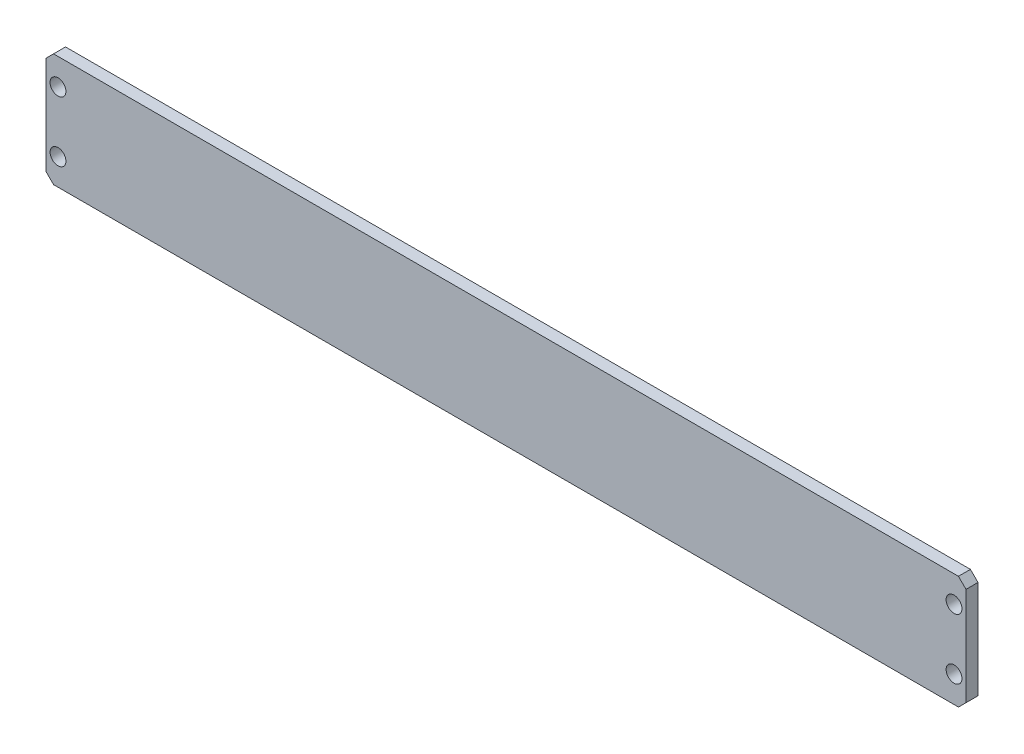
ISO-10303-21;
HEADER;
FILE_DESCRIPTION(('STEP AP214'),'2;1');
FILE_NAME('part.step','',(''),(''),'','','');
FILE_SCHEMA(('AUTOMOTIVE_DESIGN { 1 0 10303 214 1 1 1 1 }'));
ENDSEC;
DATA;
#1=APPLICATION_CONTEXT('core data for automotive mechanical design processes');
#2=APPLICATION_PROTOCOL_DEFINITION('international standard','automotive_design',2000,#1);
#3=PRODUCT_CONTEXT('',#1,'mechanical');
#4=PRODUCT('Part','Part','',(#3));
#5=PRODUCT_RELATED_PRODUCT_CATEGORY('part','',(#4));
#6=PRODUCT_DEFINITION_FORMATION('','',#4);
#7=PRODUCT_DEFINITION_CONTEXT('part definition',#1,'design');
#8=PRODUCT_DEFINITION('design','',#6,#7);
#9=PRODUCT_DEFINITION_SHAPE('','',#8);
#10=(LENGTH_UNIT() NAMED_UNIT(*) SI_UNIT(.MILLI.,.METRE.));
#11=(NAMED_UNIT(*) PLANE_ANGLE_UNIT() SI_UNIT($,.RADIAN.));
#12=(NAMED_UNIT(*) SI_UNIT($,.STERADIAN.) SOLID_ANGLE_UNIT());
#13=UNCERTAINTY_MEASURE_WITH_UNIT(LENGTH_MEASURE(1.E-05),#10,'distance_accuracy_value','');
#14=(GEOMETRIC_REPRESENTATION_CONTEXT(3) GLOBAL_UNCERTAINTY_ASSIGNED_CONTEXT((#13)) GLOBAL_UNIT_ASSIGNED_CONTEXT((#10,
#11,#12)) REPRESENTATION_CONTEXT('',''));
#15=CARTESIAN_POINT('',(0.,0.,0.));
#16=DIRECTION('',(0.,0.,1.));
#17=DIRECTION('',(1.,0.,0.));
#18=AXIS2_PLACEMENT_3D('',#15,#16,#17);
#19=CARTESIAN_POINT('',(0.,131.786291501019,3.175));
#20=DIRECTION('',(1.,0.,0.));
#21=DIRECTION('',(0.,0.,-1.));
#22=AXIS2_PLACEMENT_3D('',#19,#20,#21);
#23=PLANE('',#22);
#24=DIRECTION('',(0.,-1.,0.));
#25=VECTOR('',#24,1.);
#26=CARTESIAN_POINT('',(0.,131.786291501019,0.));
#27=LINE('',#26,#25);
#28=CARTESIAN_POINT('',(0.,129.786291501019,0.));
#29=VERTEX_POINT('',#28);
#30=CARTESIAN_POINT('',(0.,103.786291501019,0.));
#31=VERTEX_POINT('',#30);
#32=EDGE_CURVE('E129',#29,#31,#27,.T.);
#33=ORIENTED_EDGE('',*,*,#32,.T.);
#34=DIRECTION('',(0.,0.,1.));
#35=VECTOR('',#34,1.);
#36=CARTESIAN_POINT('',(0.,103.786291501019,3.175));
#37=LINE('',#36,#35);
#38=CARTESIAN_POINT('',(0.,103.786291501019,3.175));
#39=VERTEX_POINT('',#38);
#40=EDGE_CURVE('E11',#31,#39,#37,.T.);
#41=ORIENTED_EDGE('',*,*,#40,.T.);
#42=DIRECTION('',(0.,-1.,0.));
#43=VECTOR('',#42,1.);
#44=CARTESIAN_POINT('',(0.,131.786291501019,3.175));
#45=LINE('',#44,#43);
#46=CARTESIAN_POINT('',(0.,129.786291501019,3.175));
#47=VERTEX_POINT('',#46);
#48=EDGE_CURVE('E127',#47,#39,#45,.T.);
#49=ORIENTED_EDGE('',*,*,#48,.F.);
#50=DIRECTION('',(0.,0.,-1.));
#51=VECTOR('',#50,1.);
#52=CARTESIAN_POINT('',(0.,129.786291501019,3.175));
#53=LINE('',#52,#51);
#54=EDGE_CURVE('E41',#47,#29,#53,.T.);
#55=ORIENTED_EDGE('',*,*,#54,.T.);
#56=EDGE_LOOP('',(#33,#41,#49,#55));
#57=FACE_BOUND('',#56,.T.);
#58=ADVANCED_FACE('F33',(#57),#23,.F.);
#59=CARTESIAN_POINT('',(0.,101.786291501019,3.175));
#60=DIRECTION('',(0.,1.,0.));
#61=DIRECTION('',(0.,0.,1.));
#62=AXIS2_PLACEMENT_3D('',#59,#60,#61);
#63=PLANE('',#62);
#64=DIRECTION('',(1.,0.,0.));
#65=VECTOR('',#64,1.);
#66=CARTESIAN_POINT('',(0.,101.786291501019,0.));
#67=LINE('',#66,#65);
#68=CARTESIAN_POINT('',(2.,101.786291501019,0.));
#69=VERTEX_POINT('',#68);
#70=CARTESIAN_POINT('',(241.65,101.786291501019,0.));
#71=VERTEX_POINT('',#70);
#72=EDGE_CURVE('E125',#69,#71,#67,.T.);
#73=ORIENTED_EDGE('',*,*,#72,.T.);
#74=DIRECTION('',(0.,0.,1.));
#75=VECTOR('',#74,1.);
#76=CARTESIAN_POINT('',(241.65,101.786291501019,3.175));
#77=LINE('',#76,#75);
#78=CARTESIAN_POINT('',(241.65,101.786291501019,3.175));
#79=VERTEX_POINT('',#78);
#80=EDGE_CURVE('E104',#71,#79,#77,.T.);
#81=ORIENTED_EDGE('',*,*,#80,.T.);
#82=DIRECTION('',(1.,0.,0.));
#83=VECTOR('',#82,1.);
#84=CARTESIAN_POINT('',(0.,101.786291501019,3.175));
#85=LINE('',#84,#83);
#86=CARTESIAN_POINT('',(2.,101.786291501019,3.175));
#87=VERTEX_POINT('',#86);
#88=EDGE_CURVE('E169',#87,#79,#85,.T.);
#89=ORIENTED_EDGE('',*,*,#88,.F.);
#90=DIRECTION('',(0.,0.,-1.));
#91=VECTOR('',#90,1.);
#92=CARTESIAN_POINT('',(2.,101.786291501019,3.175));
#93=LINE('',#92,#91);
#94=EDGE_CURVE('E109',#87,#69,#93,.T.);
#95=ORIENTED_EDGE('',*,*,#94,.T.);
#96=EDGE_LOOP('',(#73,#81,#89,#95));
#97=FACE_BOUND('',#96,.T.);
#98=ADVANCED_FACE('F217',(#97),#63,.F.);
#99=CARTESIAN_POINT('',(243.65,131.786291501019,3.175));
#100=DIRECTION('',(-1.,0.,0.));
#101=DIRECTION('',(0.,0.,1.));
#102=AXIS2_PLACEMENT_3D('',#99,#100,#101);
#103=PLANE('',#102);
#104=DIRECTION('',(0.,1.,0.));
#105=VECTOR('',#104,1.);
#106=CARTESIAN_POINT('',(243.65,131.786291501019,3.175));
#107=LINE('',#106,#105);
#108=CARTESIAN_POINT('',(243.65,103.786291501019,3.175));
#109=VERTEX_POINT('',#108);
#110=CARTESIAN_POINT('',(243.65,129.786291501019,3.175));
#111=VERTEX_POINT('',#110);
#112=EDGE_CURVE('E118',#109,#111,#107,.T.);
#113=ORIENTED_EDGE('',*,*,#112,.F.);
#114=DIRECTION('',(0.,0.,-1.));
#115=VECTOR('',#114,1.);
#116=CARTESIAN_POINT('',(243.65,103.786291501019,3.175));
#117=LINE('',#116,#115);
#118=CARTESIAN_POINT('',(243.65,103.786291501019,0.));
#119=VERTEX_POINT('',#118);
#120=EDGE_CURVE('E103',#109,#119,#117,.T.);
#121=ORIENTED_EDGE('',*,*,#120,.T.);
#122=DIRECTION('',(0.,1.,0.));
#123=VECTOR('',#122,1.);
#124=CARTESIAN_POINT('',(243.65,131.786291501019,0.));
#125=LINE('',#124,#123);
#126=CARTESIAN_POINT('',(243.65,129.786291501019,0.));
#127=VERTEX_POINT('',#126);
#128=EDGE_CURVE('E116',#119,#127,#125,.T.);
#129=ORIENTED_EDGE('',*,*,#128,.T.);
#130=DIRECTION('',(0.,0.,1.));
#131=VECTOR('',#130,1.);
#132=CARTESIAN_POINT('',(243.65,129.786291501019,3.175));
#133=LINE('',#132,#131);
#134=EDGE_CURVE('E120',#127,#111,#133,.T.);
#135=ORIENTED_EDGE('',*,*,#134,.T.);
#136=EDGE_LOOP('',(#113,#121,#129,#135));
#137=FACE_BOUND('',#136,.T.);
#138=ADVANCED_FACE('F115',(#137),#103,.F.);
#139=CARTESIAN_POINT('',(0.,131.786291501019,3.175));
#140=DIRECTION('',(0.,-1.,0.));
#141=DIRECTION('',(0.,0.,-1.));
#142=AXIS2_PLACEMENT_3D('',#139,#140,#141);
#143=PLANE('',#142);
#144=DIRECTION('',(-1.,0.,0.));
#145=VECTOR('',#144,1.);
#146=CARTESIAN_POINT('',(0.,131.786291501019,3.175));
#147=LINE('',#146,#145);
#148=CARTESIAN_POINT('',(241.65,131.786291501019,3.175));
#149=VERTEX_POINT('',#148);
#150=CARTESIAN_POINT('',(2.00000000000004,131.786291501019,3.175));
#151=VERTEX_POINT('',#150);
#152=EDGE_CURVE('E133',#149,#151,#147,.T.);
#153=ORIENTED_EDGE('',*,*,#152,.F.);
#154=DIRECTION('',(0.,0.,-1.));
#155=VECTOR('',#154,1.);
#156=CARTESIAN_POINT('',(241.65,131.786291501019,3.175));
#157=LINE('',#156,#155);
#158=CARTESIAN_POINT('',(241.65,131.786291501019,0.));
#159=VERTEX_POINT('',#158);
#160=EDGE_CURVE('E150',#149,#159,#157,.T.);
#161=ORIENTED_EDGE('',*,*,#160,.T.);
#162=DIRECTION('',(-1.,0.,0.));
#163=VECTOR('',#162,1.);
#164=CARTESIAN_POINT('',(0.,131.786291501019,0.));
#165=LINE('',#164,#163);
#166=CARTESIAN_POINT('',(2.00000000000003,131.786291501019,0.));
#167=VERTEX_POINT('',#166);
#168=EDGE_CURVE('E124',#159,#167,#165,.T.);
#169=ORIENTED_EDGE('',*,*,#168,.T.);
#170=DIRECTION('',(0.,0.,1.));
#171=VECTOR('',#170,1.);
#172=CARTESIAN_POINT('',(2.00000000000003,131.786291501019,3.175));
#173=LINE('',#172,#171);
#174=EDGE_CURVE('E48',#167,#151,#173,.T.);
#175=ORIENTED_EDGE('',*,*,#174,.T.);
#176=EDGE_LOOP('',(#153,#161,#169,#175));
#177=FACE_BOUND('',#176,.T.);
#178=ADVANCED_FACE('F206',(#177),#143,.F.);
#179=CARTESIAN_POINT('',(0.,101.786291501019,3.175));
#180=DIRECTION('',(0.,0.,1.));
#181=DIRECTION('',(1.,0.,0.));
#182=AXIS2_PLACEMENT_3D('',#179,#180,#181);
#183=PLANE('',#182);
#184=CARTESIAN_POINT('',(240.475,124.786291501019,3.175));
#185=DIRECTION('',(0.,0.,1.));
#186=DIRECTION('',(-1.,0.,0.));
#187=AXIS2_PLACEMENT_3D('',#184,#185,#186);
#188=CIRCLE('',#187,2.10000000000001);
#189=CARTESIAN_POINT('',(238.375,124.786291501019,3.175));
#190=VERTEX_POINT('',#189);
#191=EDGE_CURVE('E188',#190,#190,#188,.T.);
#192=ORIENTED_EDGE('',*,*,#191,.F.);
#193=EDGE_LOOP('',(#192));
#194=FACE_BOUND('',#193,.T.);
#195=CARTESIAN_POINT('',(240.475,108.786291501019,3.175));
#196=DIRECTION('',(0.,0.,1.));
#197=DIRECTION('',(-1.,0.,0.));
#198=AXIS2_PLACEMENT_3D('',#195,#196,#197);
#199=CIRCLE('',#198,2.10000000000002);
#200=CARTESIAN_POINT('',(238.375,108.786291501019,3.175));
#201=VERTEX_POINT('',#200);
#202=EDGE_CURVE('E182',#201,#201,#199,.T.);
#203=ORIENTED_EDGE('',*,*,#202,.F.);
#204=EDGE_LOOP('',(#203));
#205=FACE_BOUND('',#204,.T.);
#206=CARTESIAN_POINT('',(3.175,108.786291501019,3.175));
#207=DIRECTION('',(0.,0.,1.));
#208=DIRECTION('',(1.,0.,0.));
#209=AXIS2_PLACEMENT_3D('',#206,#207,#208);
#210=CIRCLE('',#209,2.1);
#211=CARTESIAN_POINT('',(5.27500000000001,108.786291501019,3.175));
#212=VERTEX_POINT('',#211);
#213=EDGE_CURVE('E176',#212,#212,#210,.T.);
#214=ORIENTED_EDGE('',*,*,#213,.F.);
#215=EDGE_LOOP('',(#214));
#216=FACE_BOUND('',#215,.T.);
#217=CARTESIAN_POINT('',(3.175,124.786291501019,3.175));
#218=DIRECTION('',(0.,0.,1.));
#219=DIRECTION('',(1.,0.,0.));
#220=AXIS2_PLACEMENT_3D('',#217,#218,#219);
#221=CIRCLE('',#220,2.1);
#222=CARTESIAN_POINT('',(5.275,124.786291501019,3.175));
#223=VERTEX_POINT('',#222);
#224=EDGE_CURVE('E164',#223,#223,#221,.T.);
#225=ORIENTED_EDGE('',*,*,#224,.F.);
#226=EDGE_LOOP('',(#225));
#227=FACE_BOUND('',#226,.T.);
#228=ORIENTED_EDGE('',*,*,#88,.T.);
#229=DIRECTION('',(-0.707106781186552,-0.707106781186543,0.));
#230=VECTOR('',#229,1.);
#231=CARTESIAN_POINT('',(120.824999999998,-19.0387084989811,3.175));
#232=LINE('',#231,#230);
#233=EDGE_CURVE('E147',#79,#109,#232,.F.);
#234=ORIENTED_EDGE('',*,*,#233,.T.);
#235=ORIENTED_EDGE('',*,*,#112,.T.);
#236=DIRECTION('',(0.707106781186548,-0.707106781186548,0.));
#237=VECTOR('',#236,1.);
#238=CARTESIAN_POINT('',(135.825,237.611291501019,3.175));
#239=LINE('',#238,#237);
#240=EDGE_CURVE('E55',#111,#149,#239,.F.);
#241=ORIENTED_EDGE('',*,*,#240,.T.);
#242=ORIENTED_EDGE('',*,*,#152,.T.);
#243=DIRECTION('',(0.707106781186548,0.707106781186548,0.));
#244=VECTOR('',#243,1.);
#245=CARTESIAN_POINT('',(-14.,115.786291501019,3.175));
#246=LINE('',#245,#244);
#247=EDGE_CURVE('E142',#151,#47,#246,.F.);
#248=ORIENTED_EDGE('',*,*,#247,.T.);
#249=ORIENTED_EDGE('',*,*,#48,.T.);
#250=DIRECTION('',(-0.707106781186548,0.707106781186548,0.));
#251=VECTOR('',#250,1.);
#252=CARTESIAN_POINT('',(1.,102.786291501019,3.175));
#253=LINE('',#252,#251);
#254=EDGE_CURVE('E144',#39,#87,#253,.F.);
#255=ORIENTED_EDGE('',*,*,#254,.T.);
#256=EDGE_LOOP('',(#228,#234,#235,#241,#242,#248,#249,#255));
#257=FACE_BOUND('',#256,.T.);
#258=ADVANCED_FACE('F203',(#194,#205,#216,#227,#257),#183,.T.);
#259=CARTESIAN_POINT('',(0.,101.786291501019,0.));
#260=DIRECTION('',(0.,0.,1.));
#261=DIRECTION('',(1.,0.,0.));
#262=AXIS2_PLACEMENT_3D('',#259,#260,#261);
#263=PLANE('',#262);
#264=CARTESIAN_POINT('',(240.475,124.786291501019,0.));
#265=DIRECTION('',(0.,0.,1.));
#266=DIRECTION('',(-1.,0.,0.));
#267=AXIS2_PLACEMENT_3D('',#264,#265,#266);
#268=CIRCLE('',#267,2.10000000000001);
#269=CARTESIAN_POINT('',(238.375,124.786291501019,0.));
#270=VERTEX_POINT('',#269);
#271=EDGE_CURVE('E185',#270,#270,#268,.T.);
#272=ORIENTED_EDGE('',*,*,#271,.T.);
#273=EDGE_LOOP('',(#272));
#274=FACE_BOUND('',#273,.T.);
#275=CARTESIAN_POINT('',(240.475,108.786291501019,0.));
#276=DIRECTION('',(0.,0.,1.));
#277=DIRECTION('',(-1.,0.,0.));
#278=AXIS2_PLACEMENT_3D('',#275,#276,#277);
#279=CIRCLE('',#278,2.10000000000002);
#280=CARTESIAN_POINT('',(238.375,108.786291501019,0.));
#281=VERTEX_POINT('',#280);
#282=EDGE_CURVE('E179',#281,#281,#279,.T.);
#283=ORIENTED_EDGE('',*,*,#282,.T.);
#284=EDGE_LOOP('',(#283));
#285=FACE_BOUND('',#284,.T.);
#286=CARTESIAN_POINT('',(3.175,108.786291501019,0.));
#287=DIRECTION('',(0.,0.,1.));
#288=DIRECTION('',(1.,0.,0.));
#289=AXIS2_PLACEMENT_3D('',#286,#287,#288);
#290=CIRCLE('',#289,2.1);
#291=CARTESIAN_POINT('',(5.27500000000001,108.786291501019,0.));
#292=VERTEX_POINT('',#291);
#293=EDGE_CURVE('E174',#292,#292,#290,.T.);
#294=ORIENTED_EDGE('',*,*,#293,.T.);
#295=EDGE_LOOP('',(#294));
#296=FACE_BOUND('',#295,.T.);
#297=CARTESIAN_POINT('',(3.175,124.786291501019,0.));
#298=DIRECTION('',(0.,0.,1.));
#299=DIRECTION('',(1.,0.,0.));
#300=AXIS2_PLACEMENT_3D('',#297,#298,#299);
#301=CIRCLE('',#300,2.1);
#302=CARTESIAN_POINT('',(5.275,124.786291501019,0.));
#303=VERTEX_POINT('',#302);
#304=EDGE_CURVE('E162',#303,#303,#301,.T.);
#305=ORIENTED_EDGE('',*,*,#304,.T.);
#306=EDGE_LOOP('',(#305));
#307=FACE_BOUND('',#306,.T.);
#308=ORIENTED_EDGE('',*,*,#128,.F.);
#309=DIRECTION('',(0.707106781186552,0.707106781186543,0.));
#310=VECTOR('',#309,1.);
#311=CARTESIAN_POINT('',(243.65,103.786291501019,0.));
#312=LINE('',#311,#310);
#313=EDGE_CURVE('E99',#119,#71,#312,.F.);
#314=ORIENTED_EDGE('',*,*,#313,.T.);
#315=ORIENTED_EDGE('',*,*,#72,.F.);
#316=DIRECTION('',(0.707106781186548,-0.707106781186548,0.));
#317=VECTOR('',#316,1.);
#318=CARTESIAN_POINT('',(2.,101.786291501019,0.));
#319=LINE('',#318,#317);
#320=EDGE_CURVE('E136',#69,#31,#319,.F.);
#321=ORIENTED_EDGE('',*,*,#320,.T.);
#322=ORIENTED_EDGE('',*,*,#32,.F.);
#323=DIRECTION('',(-0.707106781186548,-0.707106781186548,0.));
#324=VECTOR('',#323,1.);
#325=CARTESIAN_POINT('',(0.,129.786291501019,0.));
#326=LINE('',#325,#324);
#327=EDGE_CURVE('E119',#29,#167,#326,.F.);
#328=ORIENTED_EDGE('',*,*,#327,.T.);
#329=ORIENTED_EDGE('',*,*,#168,.F.);
#330=DIRECTION('',(-0.707106781186548,0.707106781186548,0.));
#331=VECTOR('',#330,1.);
#332=CARTESIAN_POINT('',(241.65,131.786291501019,0.));
#333=LINE('',#332,#331);
#334=EDGE_CURVE('E110',#159,#127,#333,.F.);
#335=ORIENTED_EDGE('',*,*,#334,.T.);
#336=EDGE_LOOP('',(#308,#314,#315,#321,#322,#328,#329,#335));
#337=FACE_BOUND('',#336,.T.);
#338=ADVANCED_FACE('F122',(#274,#285,#296,#307,#337),#263,.F.);
#339=CARTESIAN_POINT('',(3.175,124.786291501019,0.));
#340=DIRECTION('',(0.,0.,1.));
#341=DIRECTION('',(1.,0.,0.));
#342=AXIS2_PLACEMENT_3D('',#339,#340,#341);
#343=CYLINDRICAL_SURFACE('',#342,2.1);
#344=ORIENTED_EDGE('',*,*,#304,.F.);
#345=EDGE_LOOP('',(#344));
#346=FACE_BOUND('',#345,.T.);
#347=ORIENTED_EDGE('',*,*,#224,.T.);
#348=EDGE_LOOP('',(#347));
#349=FACE_BOUND('',#348,.T.);
#350=ADVANCED_FACE('F247',(#346,#349),#343,.F.);
#351=CARTESIAN_POINT('',(3.175,108.786291501019,0.));
#352=DIRECTION('',(0.,0.,1.));
#353=DIRECTION('',(1.,0.,0.));
#354=AXIS2_PLACEMENT_3D('',#351,#352,#353);
#355=CYLINDRICAL_SURFACE('',#354,2.1);
#356=ORIENTED_EDGE('',*,*,#293,.F.);
#357=EDGE_LOOP('',(#356));
#358=FACE_BOUND('',#357,.T.);
#359=ORIENTED_EDGE('',*,*,#213,.T.);
#360=EDGE_LOOP('',(#359));
#361=FACE_BOUND('',#360,.T.);
#362=ADVANCED_FACE('F251',(#358,#361),#355,.F.);
#363=CARTESIAN_POINT('',(240.475,108.786291501019,0.));
#364=DIRECTION('',(0.,0.,1.));
#365=DIRECTION('',(1.,0.,0.));
#366=AXIS2_PLACEMENT_3D('',#363,#364,#365);
#367=CYLINDRICAL_SURFACE('',#366,2.10000000000002);
#368=ORIENTED_EDGE('',*,*,#282,.F.);
#369=EDGE_LOOP('',(#368));
#370=FACE_BOUND('',#369,.T.);
#371=ORIENTED_EDGE('',*,*,#202,.T.);
#372=EDGE_LOOP('',(#371));
#373=FACE_BOUND('',#372,.T.);
#374=ADVANCED_FACE('F199',(#370,#373),#367,.F.);
#375=CARTESIAN_POINT('',(240.475,124.786291501019,0.));
#376=DIRECTION('',(0.,0.,1.));
#377=DIRECTION('',(1.,0.,0.));
#378=AXIS2_PLACEMENT_3D('',#375,#376,#377);
#379=CYLINDRICAL_SURFACE('',#378,2.10000000000001);
#380=ORIENTED_EDGE('',*,*,#271,.F.);
#381=EDGE_LOOP('',(#380));
#382=FACE_BOUND('',#381,.T.);
#383=ORIENTED_EDGE('',*,*,#191,.T.);
#384=EDGE_LOOP('',(#383));
#385=FACE_BOUND('',#384,.T.);
#386=ADVANCED_FACE('F196',(#382,#385),#379,.F.);
#387=CARTESIAN_POINT('',(243.65,103.786291501019,3.175));
#388=DIRECTION('',(-0.707106781186543,0.707106781186552,0.));
#389=DIRECTION('',(-0.707106781186552,-0.707106781186543,0.));
#390=AXIS2_PLACEMENT_3D('',#387,#388,#389);
#391=PLANE('',#390);
#392=ORIENTED_EDGE('',*,*,#233,.F.);
#393=ORIENTED_EDGE('',*,*,#80,.F.);
#394=ORIENTED_EDGE('',*,*,#313,.F.);
#395=ORIENTED_EDGE('',*,*,#120,.F.);
#396=EDGE_LOOP('',(#392,#393,#394,#395));
#397=FACE_BOUND('',#396,.T.);
#398=ADVANCED_FACE('F102',(#397),#391,.F.);
#399=CARTESIAN_POINT('',(241.65,131.786291501019,3.175));
#400=DIRECTION('',(-0.707106781186547,-0.707106781186547,0.));
#401=DIRECTION('',(0.707106781186548,-0.707106781186548,0.));
#402=AXIS2_PLACEMENT_3D('',#399,#400,#401);
#403=PLANE('',#402);
#404=ORIENTED_EDGE('',*,*,#240,.F.);
#405=ORIENTED_EDGE('',*,*,#134,.F.);
#406=ORIENTED_EDGE('',*,*,#334,.F.);
#407=ORIENTED_EDGE('',*,*,#160,.F.);
#408=EDGE_LOOP('',(#404,#405,#406,#407));
#409=FACE_BOUND('',#408,.T.);
#410=ADVANCED_FACE('F224',(#409),#403,.F.);
#411=CARTESIAN_POINT('',(2.,101.786291501019,3.175));
#412=DIRECTION('',(0.707106781186547,0.707106781186547,0.));
#413=DIRECTION('',(-0.707106781186548,0.707106781186548,0.));
#414=AXIS2_PLACEMENT_3D('',#411,#412,#413);
#415=PLANE('',#414);
#416=ORIENTED_EDGE('',*,*,#254,.F.);
#417=ORIENTED_EDGE('',*,*,#40,.F.);
#418=ORIENTED_EDGE('',*,*,#320,.F.);
#419=ORIENTED_EDGE('',*,*,#94,.F.);
#420=EDGE_LOOP('',(#416,#417,#418,#419));
#421=FACE_BOUND('',#420,.T.);
#422=ADVANCED_FACE('F219',(#421),#415,.F.);
#423=CARTESIAN_POINT('',(0.,129.786291501019,3.175));
#424=DIRECTION('',(0.707106781186547,-0.707106781186547,0.));
#425=DIRECTION('',(0.707106781186548,0.707106781186548,0.));
#426=AXIS2_PLACEMENT_3D('',#423,#424,#425);
#427=PLANE('',#426);
#428=ORIENTED_EDGE('',*,*,#247,.F.);
#429=ORIENTED_EDGE('',*,*,#174,.F.);
#430=ORIENTED_EDGE('',*,*,#327,.F.);
#431=ORIENTED_EDGE('',*,*,#54,.F.);
#432=EDGE_LOOP('',(#428,#429,#430,#431));
#433=FACE_BOUND('',#432,.T.);
#434=ADVANCED_FACE('F35',(#433),#427,.F.);
#435=CLOSED_SHELL('',(#58,#98,#138,#178,#258,#338,#350,#362,#374,#386,#398,#410,#422,#434));
#436=MANIFOLD_SOLID_BREP('B2',#435);
#437=ADVANCED_BREP_SHAPE_REPRESENTATION('',(#18,#436),#14);
#438=SHAPE_DEFINITION_REPRESENTATION(#9,#437);
ENDSEC;
END-ISO-10303-21;
